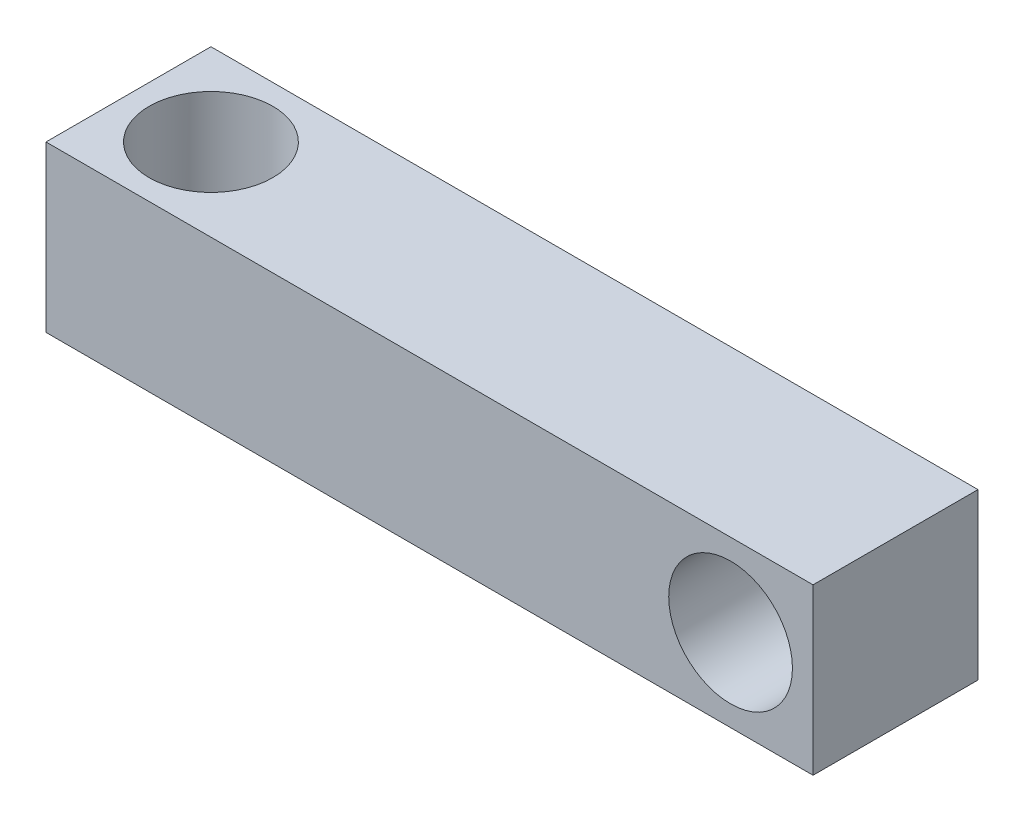
ISO-10303-21;
HEADER;
FILE_DESCRIPTION(('STEP AP214'),'2;1');
FILE_NAME('part.step','',(''),(''),'','','');
FILE_SCHEMA(('AUTOMOTIVE_DESIGN { 1 0 10303 214 1 1 1 1 }'));
ENDSEC;
DATA;
#1=APPLICATION_CONTEXT('core data for automotive mechanical design processes');
#2=APPLICATION_PROTOCOL_DEFINITION('international standard','automotive_design',2000,#1);
#3=PRODUCT_CONTEXT('',#1,'mechanical');
#4=PRODUCT('Part','Part','',(#3));
#5=PRODUCT_RELATED_PRODUCT_CATEGORY('part','',(#4));
#6=PRODUCT_DEFINITION_FORMATION('','',#4);
#7=PRODUCT_DEFINITION_CONTEXT('part definition',#1,'design');
#8=PRODUCT_DEFINITION('design','',#6,#7);
#9=PRODUCT_DEFINITION_SHAPE('','',#8);
#10=(LENGTH_UNIT() NAMED_UNIT(*) SI_UNIT(.MILLI.,.METRE.));
#11=(NAMED_UNIT(*) PLANE_ANGLE_UNIT() SI_UNIT($,.RADIAN.));
#12=(NAMED_UNIT(*) SI_UNIT($,.STERADIAN.) SOLID_ANGLE_UNIT());
#13=UNCERTAINTY_MEASURE_WITH_UNIT(LENGTH_MEASURE(1.E-05),#10,'distance_accuracy_value','');
#14=(GEOMETRIC_REPRESENTATION_CONTEXT(3) GLOBAL_UNCERTAINTY_ASSIGNED_CONTEXT((#13)) GLOBAL_UNIT_ASSIGNED_CONTEXT((#10,
#11,#12)) REPRESENTATION_CONTEXT('',''));
#15=CARTESIAN_POINT('',(0.,0.,0.));
#16=DIRECTION('',(0.,0.,1.));
#17=DIRECTION('',(1.,0.,0.));
#18=AXIS2_PLACEMENT_3D('',#15,#16,#17);
#19=CARTESIAN_POINT('',(-46.5,-8.24091778202695,10.));
#20=DIRECTION('',(1.,0.,0.));
#21=DIRECTION('',(0.,1.,0.));
#22=AXIS2_PLACEMENT_3D('',#19,#20,#21);
#23=PLANE('',#22);
#24=DIRECTION('',(0.,-1.,0.));
#25=VECTOR('',#24,1.);
#26=CARTESIAN_POINT('',(-46.5,-8.24091778202695,-10.));
#27=LINE('',#26,#25);
#28=CARTESIAN_POINT('',(-46.5,11.7590822179732,-10.));
#29=VERTEX_POINT('',#28);
#30=CARTESIAN_POINT('',(-46.5,-8.24091778202695,-10.));
#31=VERTEX_POINT('',#30);
#32=EDGE_CURVE('E94',#29,#31,#27,.T.);
#33=ORIENTED_EDGE('',*,*,#32,.T.);
#34=DIRECTION('',(0.,0.,-1.));
#35=VECTOR('',#34,1.);
#36=CARTESIAN_POINT('',(-46.5,-8.24091778202695,10.));
#37=LINE('',#36,#35);
#38=CARTESIAN_POINT('',(-46.5,-8.24091778202695,10.));
#39=VERTEX_POINT('',#38);
#40=EDGE_CURVE('E48',#39,#31,#37,.T.);
#41=ORIENTED_EDGE('',*,*,#40,.F.);
#42=DIRECTION('',(0.,-1.,0.));
#43=VECTOR('',#42,1.);
#44=CARTESIAN_POINT('',(-46.5,-8.24091778202695,10.));
#45=LINE('',#44,#43);
#46=CARTESIAN_POINT('',(-46.5,11.7590822179732,10.));
#47=VERTEX_POINT('',#46);
#48=EDGE_CURVE('E87',#47,#39,#45,.T.);
#49=ORIENTED_EDGE('',*,*,#48,.F.);
#50=DIRECTION('',(0.,0.,-1.));
#51=VECTOR('',#50,1.);
#52=CARTESIAN_POINT('',(-46.5,11.7590822179732,10.));
#53=LINE('',#52,#51);
#54=EDGE_CURVE('E11',#47,#29,#53,.T.);
#55=ORIENTED_EDGE('',*,*,#54,.T.);
#56=EDGE_LOOP('',(#33,#41,#49,#55));
#57=FACE_BOUND('',#56,.T.);
#58=ADVANCED_FACE('F39',(#57),#23,.F.);
#59=CARTESIAN_POINT('',(46.5,-8.24091778202679,10.));
#60=DIRECTION('',(0.,1.,0.));
#61=DIRECTION('',(-1.,0.,0.));
#62=AXIS2_PLACEMENT_3D('',#59,#60,#61);
#63=PLANE('',#62);
#64=CARTESIAN_POINT('',(-36.5,-8.24091778202694,0.));
#65=DIRECTION('',(0.,1.,0.));
#66=DIRECTION('',(0.,0.,1.));
#67=AXIS2_PLACEMENT_3D('',#64,#65,#66);
#68=CIRCLE('',#67,7.5);
#69=CARTESIAN_POINT('',(-36.5,-8.24091778202694,7.5));
#70=VERTEX_POINT('',#69);
#71=EDGE_CURVE('E140',#70,#70,#68,.T.);
#72=ORIENTED_EDGE('',*,*,#71,.T.);
#73=EDGE_LOOP('',(#72));
#74=FACE_BOUND('',#73,.T.);
#75=DIRECTION('',(1.,0.,0.));
#76=VECTOR('',#75,1.);
#77=CARTESIAN_POINT('',(46.5,-8.24091778202679,-10.));
#78=LINE('',#77,#76);
#79=CARTESIAN_POINT('',(46.5,-8.24091778202679,-10.));
#80=VERTEX_POINT('',#79);
#81=EDGE_CURVE('E74',#31,#80,#78,.T.);
#82=ORIENTED_EDGE('',*,*,#81,.T.);
#83=DIRECTION('',(0.,0.,-1.));
#84=VECTOR('',#83,1.);
#85=CARTESIAN_POINT('',(46.5,-8.24091778202679,10.));
#86=LINE('',#85,#84);
#87=CARTESIAN_POINT('',(46.5,-8.24091778202679,10.));
#88=VERTEX_POINT('',#87);
#89=EDGE_CURVE('E95',#88,#80,#86,.T.);
#90=ORIENTED_EDGE('',*,*,#89,.F.);
#91=DIRECTION('',(1.,0.,0.));
#92=VECTOR('',#91,1.);
#93=CARTESIAN_POINT('',(46.5,-8.24091778202679,10.));
#94=LINE('',#93,#92);
#95=EDGE_CURVE('E91',#39,#88,#94,.T.);
#96=ORIENTED_EDGE('',*,*,#95,.F.);
#97=ORIENTED_EDGE('',*,*,#40,.T.);
#98=EDGE_LOOP('',(#82,#90,#96,#97));
#99=FACE_BOUND('',#98,.T.);
#100=ADVANCED_FACE('F97',(#74,#99),#63,.F.);
#101=CARTESIAN_POINT('',(46.5,11.7590822179732,10.));
#102=DIRECTION('',(-1.,0.,0.));
#103=DIRECTION('',(0.,-1.,0.));
#104=AXIS2_PLACEMENT_3D('',#101,#102,#103);
#105=PLANE('',#104);
#106=DIRECTION('',(0.,1.,0.));
#107=VECTOR('',#106,1.);
#108=CARTESIAN_POINT('',(46.5,11.7590822179732,-10.));
#109=LINE('',#108,#107);
#110=CARTESIAN_POINT('',(46.5,11.7590822179732,-10.));
#111=VERTEX_POINT('',#110);
#112=EDGE_CURVE('E81',#80,#111,#109,.T.);
#113=ORIENTED_EDGE('',*,*,#112,.T.);
#114=DIRECTION('',(0.,0.,-1.));
#115=VECTOR('',#114,1.);
#116=CARTESIAN_POINT('',(46.5,11.7590822179732,10.));
#117=LINE('',#116,#115);
#118=CARTESIAN_POINT('',(46.5,11.7590822179732,10.));
#119=VERTEX_POINT('',#118);
#120=EDGE_CURVE('E101',#119,#111,#117,.T.);
#121=ORIENTED_EDGE('',*,*,#120,.F.);
#122=DIRECTION('',(0.,1.,0.));
#123=VECTOR('',#122,1.);
#124=CARTESIAN_POINT('',(46.5,11.7590822179732,10.));
#125=LINE('',#124,#123);
#126=EDGE_CURVE('E99',#88,#119,#125,.T.);
#127=ORIENTED_EDGE('',*,*,#126,.F.);
#128=ORIENTED_EDGE('',*,*,#89,.T.);
#129=EDGE_LOOP('',(#113,#121,#127,#128));
#130=FACE_BOUND('',#129,.T.);
#131=ADVANCED_FACE('F112',(#130),#105,.F.);
#132=CARTESIAN_POINT('',(0.,11.7590822179732,10.));
#133=DIRECTION('',(0.,-1.,0.));
#134=DIRECTION('',(1.,0.,0.));
#135=AXIS2_PLACEMENT_3D('',#132,#133,#134);
#136=PLANE('',#135);
#137=CARTESIAN_POINT('',(-36.5,11.7590822179732,0.));
#138=DIRECTION('',(0.,-1.,0.));
#139=DIRECTION('',(1.,0.,0.));
#140=AXIS2_PLACEMENT_3D('',#137,#138,#139);
#141=CIRCLE('',#140,7.5);
#142=CARTESIAN_POINT('',(-29.,11.7590822179732,0.));
#143=VERTEX_POINT('',#142);
#144=EDGE_CURVE('E42',#143,#143,#141,.T.);
#145=ORIENTED_EDGE('',*,*,#144,.T.);
#146=EDGE_LOOP('',(#145));
#147=FACE_BOUND('',#146,.T.);
#148=DIRECTION('',(-1.,0.,0.));
#149=VECTOR('',#148,1.);
#150=CARTESIAN_POINT('',(0.,11.7590822179732,-10.));
#151=LINE('',#150,#149);
#152=EDGE_CURVE('E109',#111,#29,#151,.T.);
#153=ORIENTED_EDGE('',*,*,#152,.T.);
#154=ORIENTED_EDGE('',*,*,#54,.F.);
#155=DIRECTION('',(-1.,0.,0.));
#156=VECTOR('',#155,1.);
#157=CARTESIAN_POINT('',(-46.5,11.7590822179732,10.));
#158=LINE('',#157,#156);
#159=EDGE_CURVE('E56',#119,#47,#158,.T.);
#160=ORIENTED_EDGE('',*,*,#159,.F.);
#161=ORIENTED_EDGE('',*,*,#120,.T.);
#162=EDGE_LOOP('',(#153,#154,#160,#161));
#163=FACE_BOUND('',#162,.T.);
#164=ADVANCED_FACE('F116',(#147,#163),#136,.F.);
#165=CARTESIAN_POINT('',(0.,0.,10.));
#166=DIRECTION('',(0.,0.,-1.));
#167=DIRECTION('',(-1.,0.,0.));
#168=AXIS2_PLACEMENT_3D('',#165,#166,#167);
#169=PLANE('',#168);
#170=CARTESIAN_POINT('',(36.5,1.75908221797322,10.));
#171=DIRECTION('',(0.,0.,-1.));
#172=DIRECTION('',(-1.,0.,0.));
#173=AXIS2_PLACEMENT_3D('',#170,#171,#172);
#174=CIRCLE('',#173,7.5);
#175=CARTESIAN_POINT('',(29.,1.75908221797322,10.));
#176=VERTEX_POINT('',#175);
#177=EDGE_CURVE('E106',#176,#176,#174,.T.);
#178=ORIENTED_EDGE('',*,*,#177,.T.);
#179=EDGE_LOOP('',(#178));
#180=FACE_BOUND('',#179,.T.);
#181=ORIENTED_EDGE('',*,*,#159,.T.);
#182=ORIENTED_EDGE('',*,*,#48,.T.);
#183=ORIENTED_EDGE('',*,*,#95,.T.);
#184=ORIENTED_EDGE('',*,*,#126,.T.);
#185=EDGE_LOOP('',(#181,#182,#183,#184));
#186=FACE_BOUND('',#185,.T.);
#187=ADVANCED_FACE('F89',(#180,#186),#169,.F.);
#188=CARTESIAN_POINT('',(0.,0.,-10.));
#189=DIRECTION('',(0.,0.,-1.));
#190=DIRECTION('',(-1.,0.,0.));
#191=AXIS2_PLACEMENT_3D('',#188,#189,#190);
#192=PLANE('',#191);
#193=CARTESIAN_POINT('',(36.5,1.75908221797322,-10.));
#194=DIRECTION('',(0.,0.,1.));
#195=DIRECTION('',(1.,0.,0.));
#196=AXIS2_PLACEMENT_3D('',#193,#194,#195);
#197=CIRCLE('',#196,7.5);
#198=CARTESIAN_POINT('',(44.,1.75908221797322,-10.));
#199=VERTEX_POINT('',#198);
#200=EDGE_CURVE('E143',#199,#199,#197,.T.);
#201=ORIENTED_EDGE('',*,*,#200,.T.);
#202=EDGE_LOOP('',(#201));
#203=FACE_BOUND('',#202,.T.);
#204=ORIENTED_EDGE('',*,*,#32,.F.);
#205=ORIENTED_EDGE('',*,*,#152,.F.);
#206=ORIENTED_EDGE('',*,*,#112,.F.);
#207=ORIENTED_EDGE('',*,*,#81,.F.);
#208=EDGE_LOOP('',(#204,#205,#206,#207));
#209=FACE_BOUND('',#208,.T.);
#210=ADVANCED_FACE('F115',(#203,#209),#192,.T.);
#211=CARTESIAN_POINT('',(36.5,1.75908221797322,-10.));
#212=DIRECTION('',(0.,0.,1.));
#213=DIRECTION('',(1.,0.,0.));
#214=AXIS2_PLACEMENT_3D('',#211,#212,#213);
#215=CYLINDRICAL_SURFACE('',#214,7.5);
#216=ORIENTED_EDGE('',*,*,#200,.F.);
#217=EDGE_LOOP('',(#216));
#218=FACE_BOUND('',#217,.T.);
#219=ORIENTED_EDGE('',*,*,#177,.F.);
#220=EDGE_LOOP('',(#219));
#221=FACE_BOUND('',#220,.T.);
#222=ADVANCED_FACE('F150',(#218,#221),#215,.F.);
#223=CARTESIAN_POINT('',(-36.5,-8.24091778202694,0.));
#224=DIRECTION('',(0.,1.,0.));
#225=DIRECTION('',(0.,0.,1.));
#226=AXIS2_PLACEMENT_3D('',#223,#224,#225);
#227=CYLINDRICAL_SURFACE('',#226,7.5);
#228=ORIENTED_EDGE('',*,*,#71,.F.);
#229=EDGE_LOOP('',(#228));
#230=FACE_BOUND('',#229,.T.);
#231=ORIENTED_EDGE('',*,*,#144,.F.);
#232=EDGE_LOOP('',(#231));
#233=FACE_BOUND('',#232,.T.);
#234=ADVANCED_FACE('F151',(#230,#233),#227,.F.);
#235=CLOSED_SHELL('',(#58,#100,#131,#164,#187,#210,#222,#234));
#236=MANIFOLD_SOLID_BREP('B2',#235);
#237=ADVANCED_BREP_SHAPE_REPRESENTATION('',(#18,#236),#14);
#238=SHAPE_DEFINITION_REPRESENTATION(#9,#237);
ENDSEC;
END-ISO-10303-21;
